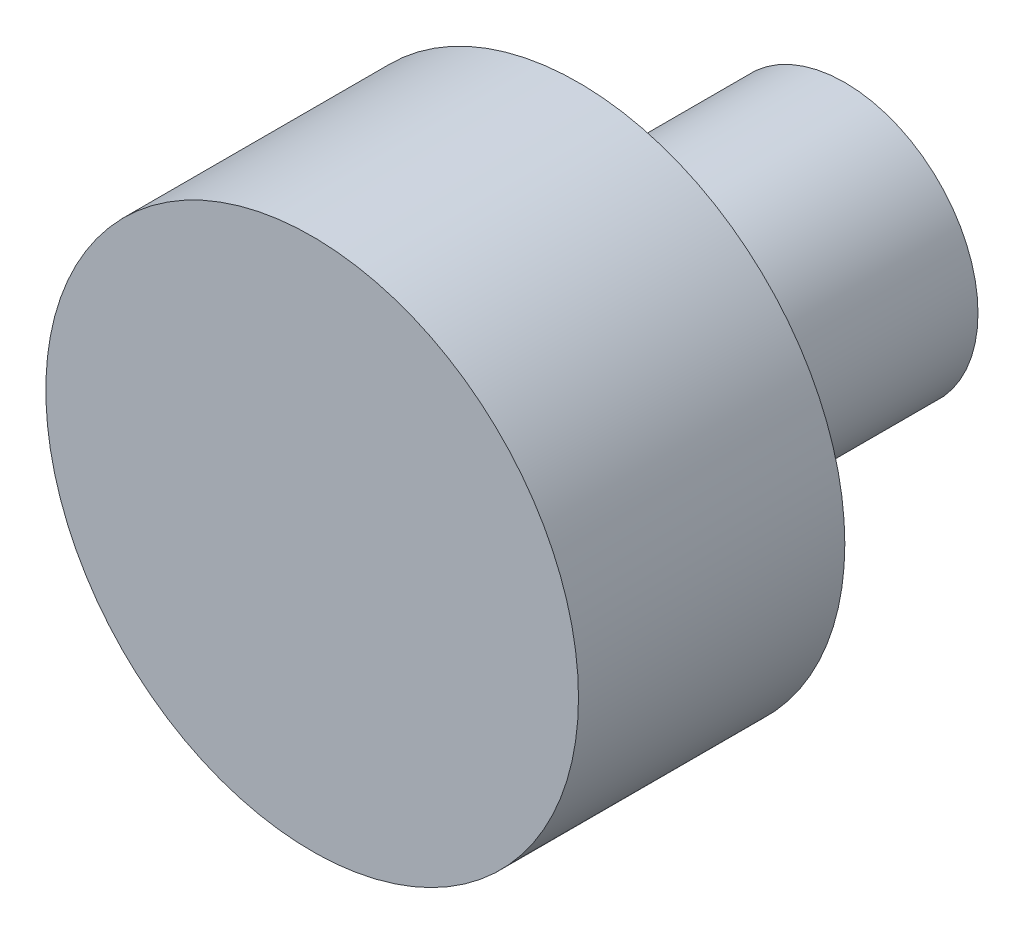
ISO-10303-21;
HEADER;
FILE_DESCRIPTION(('STEP AP214'),'2;1');
FILE_NAME('part.step','',(''),(''),'','','');
FILE_SCHEMA(('AUTOMOTIVE_DESIGN { 1 0 10303 214 1 1 1 1 }'));
ENDSEC;
DATA;
#1=APPLICATION_CONTEXT('core data for automotive mechanical design processes');
#2=APPLICATION_PROTOCOL_DEFINITION('international standard','automotive_design',2000,#1);
#3=PRODUCT_CONTEXT('',#1,'mechanical');
#4=PRODUCT('Part','Part','',(#3));
#5=PRODUCT_RELATED_PRODUCT_CATEGORY('part','',(#4));
#6=PRODUCT_DEFINITION_FORMATION('','',#4);
#7=PRODUCT_DEFINITION_CONTEXT('part definition',#1,'design');
#8=PRODUCT_DEFINITION('design','',#6,#7);
#9=PRODUCT_DEFINITION_SHAPE('','',#8);
#10=(LENGTH_UNIT() NAMED_UNIT(*) SI_UNIT(.MILLI.,.METRE.));
#11=(NAMED_UNIT(*) PLANE_ANGLE_UNIT() SI_UNIT($,.RADIAN.));
#12=(NAMED_UNIT(*) SI_UNIT($,.STERADIAN.) SOLID_ANGLE_UNIT());
#13=UNCERTAINTY_MEASURE_WITH_UNIT(LENGTH_MEASURE(1.E-05),#10,'distance_accuracy_value','');
#14=(GEOMETRIC_REPRESENTATION_CONTEXT(3) GLOBAL_UNCERTAINTY_ASSIGNED_CONTEXT((#13)) GLOBAL_UNIT_ASSIGNED_CONTEXT((#10,
#11,#12)) REPRESENTATION_CONTEXT('',''));
#15=CARTESIAN_POINT('',(0.,0.,0.));
#16=DIRECTION('',(0.,0.,1.));
#17=DIRECTION('',(1.,0.,0.));
#18=AXIS2_PLACEMENT_3D('',#15,#16,#17);
#19=CARTESIAN_POINT('',(0.,0.,20.));
#20=DIRECTION('',(0.,0.,-1.));
#21=DIRECTION('',(-1.,0.,0.));
#22=AXIS2_PLACEMENT_3D('',#19,#20,#21);
#23=CYLINDRICAL_SURFACE('',#22,10.);
#24=CARTESIAN_POINT('',(0.,0.,0.));
#25=DIRECTION('',(0.,0.,1.));
#26=DIRECTION('',(1.,0.,0.));
#27=AXIS2_PLACEMENT_3D('',#24,#25,#26);
#28=CIRCLE('',#27,10.);
#29=CARTESIAN_POINT('',(10.,0.,0.));
#30=VERTEX_POINT('',#29);
#31=EDGE_CURVE('E41',#30,#30,#28,.T.);
#32=ORIENTED_EDGE('',*,*,#31,.T.);
#33=EDGE_LOOP('',(#32));
#34=FACE_BOUND('',#33,.T.);
#35=CARTESIAN_POINT('',(0.,0.,10.));
#36=DIRECTION('',(0.,0.,1.));
#37=DIRECTION('',(1.,0.,0.));
#38=AXIS2_PLACEMENT_3D('',#35,#36,#37);
#39=CIRCLE('',#38,10.);
#40=CARTESIAN_POINT('',(10.,0.,10.));
#41=VERTEX_POINT('',#40);
#42=EDGE_CURVE('E55',#41,#41,#39,.T.);
#43=ORIENTED_EDGE('',*,*,#42,.F.);
#44=EDGE_LOOP('',(#43));
#45=FACE_BOUND('',#44,.T.);
#46=ADVANCED_FACE('F38',(#34,#45),#23,.T.);
#47=CARTESIAN_POINT('',(0.,0.,0.));
#48=DIRECTION('',(0.,0.,1.));
#49=DIRECTION('',(1.,0.,0.));
#50=AXIS2_PLACEMENT_3D('',#47,#48,#49);
#51=PLANE('',#50);
#52=CARTESIAN_POINT('',(0.,0.,0.));
#53=DIRECTION('',(0.,0.,-1.));
#54=DIRECTION('',(-1.,0.,0.));
#55=AXIS2_PLACEMENT_3D('',#52,#53,#54);
#56=CIRCLE('',#55,5.);
#57=CARTESIAN_POINT('',(-5.,0.,0.));
#58=VERTEX_POINT('',#57);
#59=EDGE_CURVE('E10',#58,#58,#56,.T.);
#60=ORIENTED_EDGE('',*,*,#59,.F.);
#61=EDGE_LOOP('',(#60));
#62=FACE_BOUND('',#61,.T.);
#63=ORIENTED_EDGE('',*,*,#31,.F.);
#64=EDGE_LOOP('',(#63));
#65=FACE_BOUND('',#64,.T.);
#66=ADVANCED_FACE('F63',(#62,#65),#51,.F.);
#67=CARTESIAN_POINT('',(0.,0.,-10.));
#68=DIRECTION('',(0.,0.,1.));
#69=DIRECTION('',(1.,0.,0.));
#70=AXIS2_PLACEMENT_3D('',#67,#68,#69);
#71=CYLINDRICAL_SURFACE('',#70,5.);
#72=CARTESIAN_POINT('',(0.,0.,-10.));
#73=DIRECTION('',(0.,0.,-1.));
#74=DIRECTION('',(-1.,0.,0.));
#75=AXIS2_PLACEMENT_3D('',#72,#73,#74);
#76=CIRCLE('',#75,5.);
#77=CARTESIAN_POINT('',(-5.,0.,-10.));
#78=VERTEX_POINT('',#77);
#79=EDGE_CURVE('E50',#78,#78,#76,.T.);
#80=ORIENTED_EDGE('',*,*,#79,.F.);
#81=EDGE_LOOP('',(#80));
#82=FACE_BOUND('',#81,.T.);
#83=ORIENTED_EDGE('',*,*,#59,.T.);
#84=EDGE_LOOP('',(#83));
#85=FACE_BOUND('',#84,.T.);
#86=ADVANCED_FACE('F70',(#82,#85),#71,.T.);
#87=CARTESIAN_POINT('',(0.,0.,-10.));
#88=DIRECTION('',(0.,0.,-1.));
#89=DIRECTION('',(-1.,0.,0.));
#90=AXIS2_PLACEMENT_3D('',#87,#88,#89);
#91=PLANE('',#90);
#92=ORIENTED_EDGE('',*,*,#79,.T.);
#93=EDGE_LOOP('',(#92));
#94=FACE_BOUND('',#93,.T.);
#95=ADVANCED_FACE('F77',(#94),#91,.T.);
#96=CARTESIAN_POINT('',(0.,0.,10.));
#97=DIRECTION('',(0.,0.,1.));
#98=DIRECTION('',(1.,0.,0.));
#99=AXIS2_PLACEMENT_3D('',#96,#97,#98);
#100=PLANE('',#99);
#101=ORIENTED_EDGE('',*,*,#42,.T.);
#102=EDGE_LOOP('',(#101));
#103=FACE_BOUND('',#102,.T.);
#104=ADVANCED_FACE('F60',(#103),#100,.T.);
#105=CLOSED_SHELL('',(#46,#66,#86,#95,#104));
#106=MANIFOLD_SOLID_BREP('B2',#105);
#107=ADVANCED_BREP_SHAPE_REPRESENTATION('',(#18,#106),#14);
#108=SHAPE_DEFINITION_REPRESENTATION(#9,#107);
ENDSEC;
END-ISO-10303-21;
